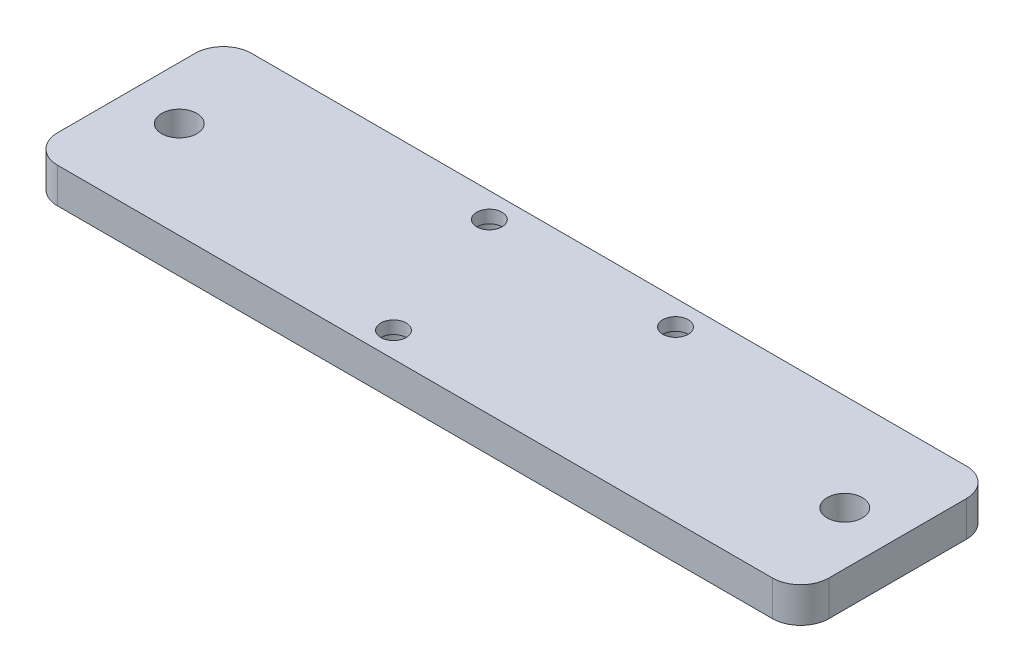
ISO-10303-21;
HEADER;
FILE_DESCRIPTION(('STEP AP214'),'2;1');
FILE_NAME('part.step','',(''),(''),'','','');
FILE_SCHEMA(('AUTOMOTIVE_DESIGN { 1 0 10303 214 1 1 1 1 }'));
ENDSEC;
DATA;
#1=APPLICATION_CONTEXT('core data for automotive mechanical design processes');
#2=APPLICATION_PROTOCOL_DEFINITION('international standard','automotive_design',2000,#1);
#3=PRODUCT_CONTEXT('',#1,'mechanical');
#4=PRODUCT('Part','Part','',(#3));
#5=PRODUCT_RELATED_PRODUCT_CATEGORY('part','',(#4));
#6=PRODUCT_DEFINITION_FORMATION('','',#4);
#7=PRODUCT_DEFINITION_CONTEXT('part definition',#1,'design');
#8=PRODUCT_DEFINITION('design','',#6,#7);
#9=PRODUCT_DEFINITION_SHAPE('','',#8);
#10=(LENGTH_UNIT() NAMED_UNIT(*) SI_UNIT(.MILLI.,.METRE.));
#11=(NAMED_UNIT(*) PLANE_ANGLE_UNIT() SI_UNIT($,.RADIAN.));
#12=(NAMED_UNIT(*) SI_UNIT($,.STERADIAN.) SOLID_ANGLE_UNIT());
#13=UNCERTAINTY_MEASURE_WITH_UNIT(LENGTH_MEASURE(1.E-05),#10,'distance_accuracy_value','');
#14=(GEOMETRIC_REPRESENTATION_CONTEXT(3) GLOBAL_UNCERTAINTY_ASSIGNED_CONTEXT((#13)) GLOBAL_UNIT_ASSIGNED_CONTEXT((#10,
#11,#12)) REPRESENTATION_CONTEXT('',''));
#15=CARTESIAN_POINT('',(0.,0.,0.));
#16=DIRECTION('',(0.,0.,1.));
#17=DIRECTION('',(1.,0.,0.));
#18=AXIS2_PLACEMENT_3D('',#15,#16,#17);
#19=CARTESIAN_POINT('',(16.764,6.35,0.));
#20=DIRECTION('',(0.,-1.,0.));
#21=DIRECTION('',(0.,0.,-1.));
#22=AXIS2_PLACEMENT_3D('',#19,#20,#21);
#23=CYLINDRICAL_SURFACE('',#22,2.286);
#24=CARTESIAN_POINT('',(16.764,6.35,0.));
#25=DIRECTION('',(0.,1.,0.));
#26=DIRECTION('',(0.,0.,1.));
#27=AXIS2_PLACEMENT_3D('',#24,#25,#26);
#28=CIRCLE('',#27,2.286);
#29=CARTESIAN_POINT('',(16.764,6.35,2.286));
#30=VERTEX_POINT('',#29);
#31=EDGE_CURVE('E189',#30,#30,#28,.T.);
#32=ORIENTED_EDGE('',*,*,#31,.T.);
#33=EDGE_LOOP('',(#32));
#34=FACE_BOUND('',#33,.T.);
#35=CARTESIAN_POINT('',(16.764,4.064,0.));
#36=DIRECTION('',(0.,-1.,0.));
#37=DIRECTION('',(0.,0.,-1.));
#38=AXIS2_PLACEMENT_3D('',#35,#36,#37);
#39=CIRCLE('',#38,2.286);
#40=CARTESIAN_POINT('',(16.764,4.064,-2.286));
#41=VERTEX_POINT('',#40);
#42=EDGE_CURVE('E145',#41,#41,#39,.T.);
#43=ORIENTED_EDGE('',*,*,#42,.T.);
#44=EDGE_LOOP('',(#43));
#45=FACE_BOUND('',#44,.T.);
#46=ADVANCED_FACE('F36',(#34,#45),#23,.F.);
#47=CARTESIAN_POINT('',(-16.764,6.35,0.));
#48=DIRECTION('',(0.,-1.,0.));
#49=DIRECTION('',(0.,0.,-1.));
#50=AXIS2_PLACEMENT_3D('',#47,#48,#49);
#51=CYLINDRICAL_SURFACE('',#50,2.286);
#52=CARTESIAN_POINT('',(-16.764,6.35,0.));
#53=DIRECTION('',(0.,1.,0.));
#54=DIRECTION('',(0.,0.,-1.));
#55=AXIS2_PLACEMENT_3D('',#52,#53,#54);
#56=CIRCLE('',#55,2.286);
#57=CARTESIAN_POINT('',(-16.764,6.35,-2.286));
#58=VERTEX_POINT('',#57);
#59=EDGE_CURVE('E191',#58,#58,#56,.T.);
#60=ORIENTED_EDGE('',*,*,#59,.T.);
#61=EDGE_LOOP('',(#60));
#62=FACE_BOUND('',#61,.T.);
#63=CARTESIAN_POINT('',(-16.764,4.064,0.));
#64=DIRECTION('',(0.,-1.,0.));
#65=DIRECTION('',(0.,0.,-1.));
#66=AXIS2_PLACEMENT_3D('',#63,#64,#65);
#67=CIRCLE('',#66,2.286);
#68=CARTESIAN_POINT('',(-16.764,4.064,-2.286));
#69=VERTEX_POINT('',#68);
#70=EDGE_CURVE('E141',#69,#69,#67,.T.);
#71=ORIENTED_EDGE('',*,*,#70,.T.);
#72=EDGE_LOOP('',(#71));
#73=FACE_BOUND('',#72,.T.);
#74=ADVANCED_FACE('F264',(#62,#73),#51,.F.);
#75=CARTESIAN_POINT('',(-8.12799999999999,6.35,25.908));
#76=DIRECTION('',(0.,-1.,0.));
#77=DIRECTION('',(0.,0.,-1.));
#78=AXIS2_PLACEMENT_3D('',#75,#76,#77);
#79=CYLINDRICAL_SURFACE('',#78,2.286);
#80=CARTESIAN_POINT('',(-8.12799999999999,6.35,25.908));
#81=DIRECTION('',(0.,1.,0.));
#82=DIRECTION('',(0.,0.,1.));
#83=AXIS2_PLACEMENT_3D('',#80,#81,#82);
#84=CIRCLE('',#83,2.286);
#85=CARTESIAN_POINT('',(-8.12799999999999,6.35,28.194));
#86=VERTEX_POINT('',#85);
#87=EDGE_CURVE('E199',#86,#86,#84,.T.);
#88=ORIENTED_EDGE('',*,*,#87,.T.);
#89=EDGE_LOOP('',(#88));
#90=FACE_BOUND('',#89,.T.);
#91=CARTESIAN_POINT('',(-8.12799999999999,4.064,25.908));
#92=DIRECTION('',(0.,-1.,0.));
#93=DIRECTION('',(0.,0.,-1.));
#94=AXIS2_PLACEMENT_3D('',#91,#92,#93);
#95=CIRCLE('',#94,2.286);
#96=CARTESIAN_POINT('',(-8.12799999999999,4.064,23.622));
#97=VERTEX_POINT('',#96);
#98=EDGE_CURVE('E138',#97,#97,#95,.T.);
#99=ORIENTED_EDGE('',*,*,#98,.T.);
#100=EDGE_LOOP('',(#99));
#101=FACE_BOUND('',#100,.T.);
#102=ADVANCED_FACE('F270',(#90,#101),#79,.F.);
#103=CARTESIAN_POINT('',(0.,6.35,0.));
#104=DIRECTION('',(0.,1.,0.));
#105=DIRECTION('',(0.,0.,1.));
#106=AXIS2_PLACEMENT_3D('',#103,#104,#105);
#107=PLANE('',#106);
#108=CARTESIAN_POINT('',(60.198,6.35,12.954));
#109=DIRECTION('',(0.,1.,0.));
#110=DIRECTION('',(0.,0.,1.));
#111=AXIS2_PLACEMENT_3D('',#108,#109,#110);
#112=CIRCLE('',#111,3.175);
#113=CARTESIAN_POINT('',(60.198,6.35,16.129));
#114=VERTEX_POINT('',#113);
#115=EDGE_CURVE('E202',#114,#114,#112,.T.);
#116=ORIENTED_EDGE('',*,*,#115,.F.);
#117=EDGE_LOOP('',(#116));
#118=FACE_BOUND('',#117,.T.);
#119=ORIENTED_EDGE('',*,*,#59,.F.);
#120=EDGE_LOOP('',(#119));
#121=FACE_BOUND('',#120,.T.);
#122=DIRECTION('',(0.,0.,-1.));
#123=VECTOR('',#122,1.);
#124=CARTESIAN_POINT('',(69.723,6.35,30.4165));
#125=LINE('',#124,#123);
#126=CARTESIAN_POINT('',(69.723,6.35,25.3365));
#127=VERTEX_POINT('',#126);
#128=CARTESIAN_POINT('',(69.723,6.35,0.571499999999996));
#129=VERTEX_POINT('',#128);
#130=EDGE_CURVE('E183',#127,#129,#125,.T.);
#131=ORIENTED_EDGE('',*,*,#130,.T.);
#132=CARTESIAN_POINT('',(64.643,6.35,0.571499999999997));
#133=DIRECTION('',(0.,1.,0.));
#134=DIRECTION('',(0.,0.,1.));
#135=AXIS2_PLACEMENT_3D('',#132,#133,#134);
#136=CIRCLE('',#135,5.08);
#137=CARTESIAN_POINT('',(64.643,6.35,-4.5085));
#138=VERTEX_POINT('',#137);
#139=EDGE_CURVE('E162',#129,#138,#136,.T.);
#140=ORIENTED_EDGE('',*,*,#139,.T.);
#141=DIRECTION('',(-1.,0.,0.));
#142=VECTOR('',#141,1.);
#143=CARTESIAN_POINT('',(-69.1846838076504,6.35,-4.50849999999999));
#144=LINE('',#143,#142);
#145=CARTESIAN_POINT('',(-64.1046838076504,6.35,-4.50849999999999));
#146=VERTEX_POINT('',#145);
#147=EDGE_CURVE('E121',#138,#146,#144,.T.);
#148=ORIENTED_EDGE('',*,*,#147,.T.);
#149=CARTESIAN_POINT('',(-64.1046838076504,6.35,0.571500000000013));
#150=DIRECTION('',(0.,1.,0.));
#151=DIRECTION('',(0.,0.,1.));
#152=AXIS2_PLACEMENT_3D('',#149,#150,#151);
#153=CIRCLE('',#152,5.08);
#154=CARTESIAN_POINT('',(-69.1846838076504,6.35,0.571500000000013));
#155=VERTEX_POINT('',#154);
#156=EDGE_CURVE('E57',#146,#155,#153,.T.);
#157=ORIENTED_EDGE('',*,*,#156,.T.);
#158=DIRECTION('',(0.,0.,1.));
#159=VECTOR('',#158,1.);
#160=CARTESIAN_POINT('',(-69.1846838076504,6.35,30.4165));
#161=LINE('',#160,#159);
#162=CARTESIAN_POINT('',(-69.1846838076504,6.35,25.3365));
#163=VERTEX_POINT('',#162);
#164=EDGE_CURVE('E149',#155,#163,#161,.T.);
#165=ORIENTED_EDGE('',*,*,#164,.T.);
#166=CARTESIAN_POINT('',(-64.1046838076504,6.35,25.3365));
#167=DIRECTION('',(0.,1.,0.));
#168=DIRECTION('',(0.,0.,1.));
#169=AXIS2_PLACEMENT_3D('',#166,#167,#168);
#170=CIRCLE('',#169,5.08);
#171=CARTESIAN_POINT('',(-64.1046838076504,6.35,30.4165));
#172=VERTEX_POINT('',#171);
#173=EDGE_CURVE('E157',#163,#172,#170,.T.);
#174=ORIENTED_EDGE('',*,*,#173,.T.);
#175=DIRECTION('',(1.,0.,0.));
#176=VECTOR('',#175,1.);
#177=CARTESIAN_POINT('',(-69.1846838076504,6.35,30.4165));
#178=LINE('',#177,#176);
#179=CARTESIAN_POINT('',(64.643,6.35,30.4165));
#180=VERTEX_POINT('',#179);
#181=EDGE_CURVE('E132',#172,#180,#178,.T.);
#182=ORIENTED_EDGE('',*,*,#181,.T.);
#183=CARTESIAN_POINT('',(64.643,6.35,25.3365));
#184=DIRECTION('',(0.,1.,0.));
#185=DIRECTION('',(0.,0.,1.));
#186=AXIS2_PLACEMENT_3D('',#183,#184,#185);
#187=CIRCLE('',#186,5.08);
#188=EDGE_CURVE('E160',#180,#127,#187,.T.);
#189=ORIENTED_EDGE('',*,*,#188,.T.);
#190=EDGE_LOOP('',(#131,#140,#148,#157,#165,#174,#182,#189));
#191=FACE_BOUND('',#190,.T.);
#192=ORIENTED_EDGE('',*,*,#31,.F.);
#193=EDGE_LOOP('',(#192));
#194=FACE_BOUND('',#193,.T.);
#195=ORIENTED_EDGE('',*,*,#87,.F.);
#196=EDGE_LOOP('',(#195));
#197=FACE_BOUND('',#196,.T.);
#198=CARTESIAN_POINT('',(-59.6596838076504,6.35,12.954));
#199=DIRECTION('',(0.,1.,0.));
#200=DIRECTION('',(0.,0.,1.));
#201=AXIS2_PLACEMENT_3D('',#198,#199,#200);
#202=CIRCLE('',#201,3.175);
#203=CARTESIAN_POINT('',(-59.6596838076504,6.35,16.129));
#204=VERTEX_POINT('',#203);
#205=EDGE_CURVE('E206',#204,#204,#202,.T.);
#206=ORIENTED_EDGE('',*,*,#205,.F.);
#207=EDGE_LOOP('',(#206));
#208=FACE_BOUND('',#207,.T.);
#209=ADVANCED_FACE('F179',(#118,#121,#191,#194,#197,#208),#107,.T.);
#210=CARTESIAN_POINT('',(0.,0.,0.));
#211=DIRECTION('',(0.,1.,0.));
#212=DIRECTION('',(0.,0.,1.));
#213=AXIS2_PLACEMENT_3D('',#210,#211,#212);
#214=PLANE('',#213);
#215=CARTESIAN_POINT('',(-8.12799999999999,0.,25.908));
#216=DIRECTION('',(0.,-1.,0.));
#217=DIRECTION('',(0.,0.,-1.));
#218=AXIS2_PLACEMENT_3D('',#215,#216,#217);
#219=CIRCLE('',#218,3.556);
#220=CARTESIAN_POINT('',(-8.12799999999999,0.,22.352));
#221=VERTEX_POINT('',#220);
#222=EDGE_CURVE('E225',#221,#221,#219,.T.);
#223=ORIENTED_EDGE('',*,*,#222,.F.);
#224=EDGE_LOOP('',(#223));
#225=FACE_BOUND('',#224,.T.);
#226=CARTESIAN_POINT('',(-16.764,0.,0.));
#227=DIRECTION('',(0.,-1.,0.));
#228=DIRECTION('',(0.,0.,-1.));
#229=AXIS2_PLACEMENT_3D('',#226,#227,#228);
#230=CIRCLE('',#229,3.556);
#231=CARTESIAN_POINT('',(-16.764,0.,-3.556));
#232=VERTEX_POINT('',#231);
#233=EDGE_CURVE('E222',#232,#232,#230,.T.);
#234=ORIENTED_EDGE('',*,*,#233,.F.);
#235=EDGE_LOOP('',(#234));
#236=FACE_BOUND('',#235,.T.);
#237=CARTESIAN_POINT('',(16.764,0.,0.));
#238=DIRECTION('',(0.,-1.,0.));
#239=DIRECTION('',(0.,0.,-1.));
#240=AXIS2_PLACEMENT_3D('',#237,#238,#239);
#241=CIRCLE('',#240,3.556);
#242=CARTESIAN_POINT('',(16.764,0.,-3.556));
#243=VERTEX_POINT('',#242);
#244=EDGE_CURVE('E216',#243,#243,#241,.T.);
#245=ORIENTED_EDGE('',*,*,#244,.F.);
#246=EDGE_LOOP('',(#245));
#247=FACE_BOUND('',#246,.T.);
#248=DIRECTION('',(-1.,0.,0.));
#249=VECTOR('',#248,1.);
#250=CARTESIAN_POINT('',(-69.1846838076504,0.,-4.50849999999999));
#251=LINE('',#250,#249);
#252=CARTESIAN_POINT('',(64.643,0.,-4.5085));
#253=VERTEX_POINT('',#252);
#254=CARTESIAN_POINT('',(-64.1046838076504,0.,-4.50849999999999));
#255=VERTEX_POINT('',#254);
#256=EDGE_CURVE('E119',#253,#255,#251,.T.);
#257=ORIENTED_EDGE('',*,*,#256,.F.);
#258=CARTESIAN_POINT('',(64.643,0.,0.571499999999997));
#259=DIRECTION('',(0.,1.,0.));
#260=DIRECTION('',(0.,0.,1.));
#261=AXIS2_PLACEMENT_3D('',#258,#259,#260);
#262=CIRCLE('',#261,5.08);
#263=CARTESIAN_POINT('',(69.723,0.,0.571499999999996));
#264=VERTEX_POINT('',#263);
#265=EDGE_CURVE('E102',#253,#264,#262,.F.);
#266=ORIENTED_EDGE('',*,*,#265,.T.);
#267=DIRECTION('',(0.,0.,-1.));
#268=VECTOR('',#267,1.);
#269=CARTESIAN_POINT('',(69.723,0.,30.4165));
#270=LINE('',#269,#268);
#271=CARTESIAN_POINT('',(69.723,0.,25.3365));
#272=VERTEX_POINT('',#271);
#273=EDGE_CURVE('E130',#272,#264,#270,.T.);
#274=ORIENTED_EDGE('',*,*,#273,.F.);
#275=CARTESIAN_POINT('',(64.643,0.,25.3365));
#276=DIRECTION('',(0.,1.,0.));
#277=DIRECTION('',(0.,0.,1.));
#278=AXIS2_PLACEMENT_3D('',#275,#276,#277);
#279=CIRCLE('',#278,5.08);
#280=CARTESIAN_POINT('',(64.643,0.,30.4165));
#281=VERTEX_POINT('',#280);
#282=EDGE_CURVE('E113',#272,#281,#279,.F.);
#283=ORIENTED_EDGE('',*,*,#282,.T.);
#284=DIRECTION('',(1.,0.,0.));
#285=VECTOR('',#284,1.);
#286=CARTESIAN_POINT('',(-69.1846838076504,0.,30.4165));
#287=LINE('',#286,#285);
#288=CARTESIAN_POINT('',(-64.1046838076504,0.,30.4165));
#289=VERTEX_POINT('',#288);
#290=EDGE_CURVE('E134',#289,#281,#287,.T.);
#291=ORIENTED_EDGE('',*,*,#290,.F.);
#292=CARTESIAN_POINT('',(-64.1046838076504,0.,25.3365));
#293=DIRECTION('',(0.,1.,0.));
#294=DIRECTION('',(0.,0.,1.));
#295=AXIS2_PLACEMENT_3D('',#292,#293,#294);
#296=CIRCLE('',#295,5.08);
#297=CARTESIAN_POINT('',(-69.1846838076504,0.,25.3365));
#298=VERTEX_POINT('',#297);
#299=EDGE_CURVE('E122',#289,#298,#296,.F.);
#300=ORIENTED_EDGE('',*,*,#299,.T.);
#301=DIRECTION('',(0.,0.,1.));
#302=VECTOR('',#301,1.);
#303=CARTESIAN_POINT('',(-69.1846838076504,0.,30.4165));
#304=LINE('',#303,#302);
#305=CARTESIAN_POINT('',(-69.1846838076504,0.,0.571500000000013));
#306=VERTEX_POINT('',#305);
#307=EDGE_CURVE('E129',#306,#298,#304,.T.);
#308=ORIENTED_EDGE('',*,*,#307,.F.);
#309=CARTESIAN_POINT('',(-64.1046838076504,0.,0.571500000000013));
#310=DIRECTION('',(0.,1.,0.));
#311=DIRECTION('',(0.,0.,1.));
#312=AXIS2_PLACEMENT_3D('',#309,#310,#311);
#313=CIRCLE('',#312,5.08);
#314=EDGE_CURVE('E128',#306,#255,#313,.F.);
#315=ORIENTED_EDGE('',*,*,#314,.T.);
#316=EDGE_LOOP('',(#257,#266,#274,#283,#291,#300,#308,#315));
#317=FACE_BOUND('',#316,.T.);
#318=CARTESIAN_POINT('',(60.198,0.,12.954));
#319=DIRECTION('',(0.,1.,0.));
#320=DIRECTION('',(0.,0.,1.));
#321=AXIS2_PLACEMENT_3D('',#318,#319,#320);
#322=CIRCLE('',#321,3.175);
#323=CARTESIAN_POINT('',(60.198,0.,16.129));
#324=VERTEX_POINT('',#323);
#325=EDGE_CURVE('E203',#324,#324,#322,.T.);
#326=ORIENTED_EDGE('',*,*,#325,.T.);
#327=EDGE_LOOP('',(#326));
#328=FACE_BOUND('',#327,.T.);
#329=CARTESIAN_POINT('',(-59.6596838076504,0.,12.954));
#330=DIRECTION('',(0.,1.,0.));
#331=DIRECTION('',(0.,0.,1.));
#332=AXIS2_PLACEMENT_3D('',#329,#330,#331);
#333=CIRCLE('',#332,3.175);
#334=CARTESIAN_POINT('',(-59.6596838076504,0.,16.129));
#335=VERTEX_POINT('',#334);
#336=EDGE_CURVE('E148',#335,#335,#333,.T.);
#337=ORIENTED_EDGE('',*,*,#336,.T.);
#338=EDGE_LOOP('',(#337));
#339=FACE_BOUND('',#338,.T.);
#340=ADVANCED_FACE('F125',(#225,#236,#247,#317,#328,#339),#214,.F.);
#341=CARTESIAN_POINT('',(-69.1846838076504,6.35,30.4165));
#342=DIRECTION('',(0.,0.,-1.));
#343=DIRECTION('',(-1.,0.,0.));
#344=AXIS2_PLACEMENT_3D('',#341,#342,#343);
#345=PLANE('',#344);
#346=ORIENTED_EDGE('',*,*,#290,.T.);
#347=DIRECTION('',(0.,-1.,0.));
#348=VECTOR('',#347,1.);
#349=CARTESIAN_POINT('',(64.643,6.35,30.4165));
#350=LINE('',#349,#348);
#351=EDGE_CURVE('E167',#281,#180,#350,.F.);
#352=ORIENTED_EDGE('',*,*,#351,.T.);
#353=ORIENTED_EDGE('',*,*,#181,.F.);
#354=DIRECTION('',(0.,-1.,0.));
#355=VECTOR('',#354,1.);
#356=CARTESIAN_POINT('',(-64.1046838076504,6.35,30.4165));
#357=LINE('',#356,#355);
#358=EDGE_CURVE('E164',#172,#289,#357,.T.);
#359=ORIENTED_EDGE('',*,*,#358,.T.);
#360=EDGE_LOOP('',(#346,#352,#353,#359));
#361=FACE_BOUND('',#360,.T.);
#362=ADVANCED_FACE('F173',(#361),#345,.F.);
#363=CARTESIAN_POINT('',(69.723,6.35,30.4165));
#364=DIRECTION('',(-1.,0.,0.));
#365=DIRECTION('',(0.,0.,1.));
#366=AXIS2_PLACEMENT_3D('',#363,#364,#365);
#367=PLANE('',#366);
#368=ORIENTED_EDGE('',*,*,#273,.T.);
#369=DIRECTION('',(0.,-1.,0.));
#370=VECTOR('',#369,1.);
#371=CARTESIAN_POINT('',(69.723,6.35,0.571499999999996));
#372=LINE('',#371,#370);
#373=EDGE_CURVE('E107',#264,#129,#372,.F.);
#374=ORIENTED_EDGE('',*,*,#373,.T.);
#375=ORIENTED_EDGE('',*,*,#130,.F.);
#376=DIRECTION('',(0.,-1.,0.));
#377=VECTOR('',#376,1.);
#378=CARTESIAN_POINT('',(69.723,6.35,25.3365));
#379=LINE('',#378,#377);
#380=EDGE_CURVE('E112',#127,#272,#379,.T.);
#381=ORIENTED_EDGE('',*,*,#380,.T.);
#382=EDGE_LOOP('',(#368,#374,#375,#381));
#383=FACE_BOUND('',#382,.T.);
#384=ADVANCED_FACE('F188',(#383),#367,.F.);
#385=CARTESIAN_POINT('',(-69.1846838076504,6.35,-4.50849999999999));
#386=DIRECTION('',(0.,0.,1.));
#387=DIRECTION('',(1.,0.,0.));
#388=AXIS2_PLACEMENT_3D('',#385,#386,#387);
#389=PLANE('',#388);
#390=ORIENTED_EDGE('',*,*,#147,.F.);
#391=DIRECTION('',(0.,-1.,0.));
#392=VECTOR('',#391,1.);
#393=CARTESIAN_POINT('',(64.643,6.35,-4.5085));
#394=LINE('',#393,#392);
#395=EDGE_CURVE('E106',#138,#253,#394,.T.);
#396=ORIENTED_EDGE('',*,*,#395,.T.);
#397=ORIENTED_EDGE('',*,*,#256,.T.);
#398=DIRECTION('',(0.,-1.,0.));
#399=VECTOR('',#398,1.);
#400=CARTESIAN_POINT('',(-64.1046838076504,6.35,-4.50849999999999));
#401=LINE('',#400,#399);
#402=EDGE_CURVE('E123',#255,#146,#401,.F.);
#403=ORIENTED_EDGE('',*,*,#402,.T.);
#404=EDGE_LOOP('',(#390,#396,#397,#403));
#405=FACE_BOUND('',#404,.T.);
#406=ADVANCED_FACE('F118',(#405),#389,.F.);
#407=CARTESIAN_POINT('',(-69.1846838076504,6.35,30.4165));
#408=DIRECTION('',(1.,0.,0.));
#409=DIRECTION('',(0.,0.,-1.));
#410=AXIS2_PLACEMENT_3D('',#407,#408,#409);
#411=PLANE('',#410);
#412=ORIENTED_EDGE('',*,*,#164,.F.);
#413=DIRECTION('',(0.,-1.,0.));
#414=VECTOR('',#413,1.);
#415=CARTESIAN_POINT('',(-69.1846838076504,6.35,0.571500000000013));
#416=LINE('',#415,#414);
#417=EDGE_CURVE('E11',#155,#306,#416,.T.);
#418=ORIENTED_EDGE('',*,*,#417,.T.);
#419=ORIENTED_EDGE('',*,*,#307,.T.);
#420=DIRECTION('',(0.,-1.,0.));
#421=VECTOR('',#420,1.);
#422=CARTESIAN_POINT('',(-69.1846838076504,6.35,25.3365));
#423=LINE('',#422,#421);
#424=EDGE_CURVE('E44',#298,#163,#423,.F.);
#425=ORIENTED_EDGE('',*,*,#424,.T.);
#426=EDGE_LOOP('',(#412,#418,#419,#425));
#427=FACE_BOUND('',#426,.T.);
#428=ADVANCED_FACE('F279',(#427),#411,.F.);
#429=CARTESIAN_POINT('',(60.198,6.35,12.954));
#430=DIRECTION('',(0.,-1.,0.));
#431=DIRECTION('',(0.,0.,-1.));
#432=AXIS2_PLACEMENT_3D('',#429,#430,#431);
#433=CYLINDRICAL_SURFACE('',#432,3.175);
#434=ORIENTED_EDGE('',*,*,#115,.T.);
#435=EDGE_LOOP('',(#434));
#436=FACE_BOUND('',#435,.T.);
#437=ORIENTED_EDGE('',*,*,#325,.F.);
#438=EDGE_LOOP('',(#437));
#439=FACE_BOUND('',#438,.T.);
#440=ADVANCED_FACE('F282',(#436,#439),#433,.F.);
#441=CARTESIAN_POINT('',(-59.6596838076504,6.35,12.954));
#442=DIRECTION('',(0.,-1.,0.));
#443=DIRECTION('',(0.,0.,-1.));
#444=AXIS2_PLACEMENT_3D('',#441,#442,#443);
#445=CYLINDRICAL_SURFACE('',#444,3.175);
#446=ORIENTED_EDGE('',*,*,#205,.T.);
#447=EDGE_LOOP('',(#446));
#448=FACE_BOUND('',#447,.T.);
#449=ORIENTED_EDGE('',*,*,#336,.F.);
#450=EDGE_LOOP('',(#449));
#451=FACE_BOUND('',#450,.T.);
#452=ADVANCED_FACE('F236',(#448,#451),#445,.F.);
#453=CARTESIAN_POINT('',(-8.12799999999999,4.064,25.908));
#454=DIRECTION('',(0.,-1.,0.));
#455=DIRECTION('',(0.,0.,-1.));
#456=AXIS2_PLACEMENT_3D('',#453,#454,#455);
#457=CYLINDRICAL_SURFACE('',#456,3.556);
#458=CARTESIAN_POINT('',(-8.12799999999999,4.064,25.908));
#459=DIRECTION('',(0.,-1.,0.));
#460=DIRECTION('',(0.,0.,-1.));
#461=AXIS2_PLACEMENT_3D('',#458,#459,#460);
#462=CIRCLE('',#461,3.556);
#463=CARTESIAN_POINT('',(-8.12799999999999,4.064,22.352));
#464=VERTEX_POINT('',#463);
#465=EDGE_CURVE('E142',#464,#464,#462,.T.);
#466=ORIENTED_EDGE('',*,*,#465,.F.);
#467=EDGE_LOOP('',(#466));
#468=FACE_BOUND('',#467,.T.);
#469=ORIENTED_EDGE('',*,*,#222,.T.);
#470=EDGE_LOOP('',(#469));
#471=FACE_BOUND('',#470,.T.);
#472=ADVANCED_FACE('F233',(#468,#471),#457,.F.);
#473=CARTESIAN_POINT('',(-8.12799999999999,4.064,25.908));
#474=DIRECTION('',(0.,-1.,0.));
#475=DIRECTION('',(0.,0.,-1.));
#476=AXIS2_PLACEMENT_3D('',#473,#474,#475);
#477=PLANE('',#476);
#478=ORIENTED_EDGE('',*,*,#98,.F.);
#479=EDGE_LOOP('',(#478));
#480=FACE_BOUND('',#479,.T.);
#481=ORIENTED_EDGE('',*,*,#465,.T.);
#482=EDGE_LOOP('',(#481));
#483=FACE_BOUND('',#482,.T.);
#484=ADVANCED_FACE('F231',(#480,#483),#477,.T.);
#485=CARTESIAN_POINT('',(-16.764,4.064,0.));
#486=DIRECTION('',(0.,-1.,0.));
#487=DIRECTION('',(0.,0.,-1.));
#488=AXIS2_PLACEMENT_3D('',#485,#486,#487);
#489=CYLINDRICAL_SURFACE('',#488,3.556);
#490=CARTESIAN_POINT('',(-16.764,4.064,0.));
#491=DIRECTION('',(0.,-1.,0.));
#492=DIRECTION('',(0.,0.,-1.));
#493=AXIS2_PLACEMENT_3D('',#490,#491,#492);
#494=CIRCLE('',#493,3.556);
#495=CARTESIAN_POINT('',(-16.764,4.064,-3.556));
#496=VERTEX_POINT('',#495);
#497=EDGE_CURVE('E219',#496,#496,#494,.T.);
#498=ORIENTED_EDGE('',*,*,#497,.F.);
#499=EDGE_LOOP('',(#498));
#500=FACE_BOUND('',#499,.T.);
#501=ORIENTED_EDGE('',*,*,#233,.T.);
#502=EDGE_LOOP('',(#501));
#503=FACE_BOUND('',#502,.T.);
#504=ADVANCED_FACE('F259',(#500,#503),#489,.F.);
#505=CARTESIAN_POINT('',(-16.764,4.064,0.));
#506=DIRECTION('',(0.,-1.,0.));
#507=DIRECTION('',(0.,0.,-1.));
#508=AXIS2_PLACEMENT_3D('',#505,#506,#507);
#509=PLANE('',#508);
#510=ORIENTED_EDGE('',*,*,#70,.F.);
#511=EDGE_LOOP('',(#510));
#512=FACE_BOUND('',#511,.T.);
#513=ORIENTED_EDGE('',*,*,#497,.T.);
#514=EDGE_LOOP('',(#513));
#515=FACE_BOUND('',#514,.T.);
#516=ADVANCED_FACE('F250',(#512,#515),#509,.T.);
#517=CARTESIAN_POINT('',(16.764,4.064,0.));
#518=DIRECTION('',(0.,-1.,0.));
#519=DIRECTION('',(0.,0.,-1.));
#520=AXIS2_PLACEMENT_3D('',#517,#518,#519);
#521=CYLINDRICAL_SURFACE('',#520,3.556);
#522=CARTESIAN_POINT('',(16.764,4.064,0.));
#523=DIRECTION('',(0.,-1.,0.));
#524=DIRECTION('',(0.,0.,-1.));
#525=AXIS2_PLACEMENT_3D('',#522,#523,#524);
#526=CIRCLE('',#525,3.556);
#527=CARTESIAN_POINT('',(16.764,4.064,-3.556));
#528=VERTEX_POINT('',#527);
#529=EDGE_CURVE('E213',#528,#528,#526,.T.);
#530=ORIENTED_EDGE('',*,*,#529,.F.);
#531=EDGE_LOOP('',(#530));
#532=FACE_BOUND('',#531,.T.);
#533=ORIENTED_EDGE('',*,*,#244,.T.);
#534=EDGE_LOOP('',(#533));
#535=FACE_BOUND('',#534,.T.);
#536=ADVANCED_FACE('F247',(#532,#535),#521,.F.);
#537=CARTESIAN_POINT('',(16.764,4.064,0.));
#538=DIRECTION('',(0.,-1.,0.));
#539=DIRECTION('',(0.,0.,-1.));
#540=AXIS2_PLACEMENT_3D('',#537,#538,#539);
#541=PLANE('',#540);
#542=ORIENTED_EDGE('',*,*,#42,.F.);
#543=EDGE_LOOP('',(#542));
#544=FACE_BOUND('',#543,.T.);
#545=ORIENTED_EDGE('',*,*,#529,.T.);
#546=EDGE_LOOP('',(#545));
#547=FACE_BOUND('',#546,.T.);
#548=ADVANCED_FACE('F249',(#544,#547),#541,.T.);
#549=CARTESIAN_POINT('',(64.643,6.35,0.571499999999997));
#550=DIRECTION('',(0.,-1.,0.));
#551=DIRECTION('',(0.,0.,-1.));
#552=AXIS2_PLACEMENT_3D('',#549,#550,#551);
#553=CYLINDRICAL_SURFACE('',#552,5.08);
#554=ORIENTED_EDGE('',*,*,#139,.F.);
#555=ORIENTED_EDGE('',*,*,#373,.F.);
#556=ORIENTED_EDGE('',*,*,#265,.F.);
#557=ORIENTED_EDGE('',*,*,#395,.F.);
#558=EDGE_LOOP('',(#554,#555,#556,#557));
#559=FACE_BOUND('',#558,.T.);
#560=ADVANCED_FACE('F105',(#559),#553,.T.);
#561=CARTESIAN_POINT('',(64.643,6.35,25.3365));
#562=DIRECTION('',(0.,-1.,0.));
#563=DIRECTION('',(0.,0.,-1.));
#564=AXIS2_PLACEMENT_3D('',#561,#562,#563);
#565=CYLINDRICAL_SURFACE('',#564,5.08);
#566=ORIENTED_EDGE('',*,*,#188,.F.);
#567=ORIENTED_EDGE('',*,*,#351,.F.);
#568=ORIENTED_EDGE('',*,*,#282,.F.);
#569=ORIENTED_EDGE('',*,*,#380,.F.);
#570=EDGE_LOOP('',(#566,#567,#568,#569));
#571=FACE_BOUND('',#570,.T.);
#572=ADVANCED_FACE('F186',(#571),#565,.T.);
#573=CARTESIAN_POINT('',(-64.1046838076504,6.35,0.571500000000013));
#574=DIRECTION('',(0.,-1.,0.));
#575=DIRECTION('',(0.,0.,-1.));
#576=AXIS2_PLACEMENT_3D('',#573,#574,#575);
#577=CYLINDRICAL_SURFACE('',#576,5.08);
#578=ORIENTED_EDGE('',*,*,#156,.F.);
#579=ORIENTED_EDGE('',*,*,#402,.F.);
#580=ORIENTED_EDGE('',*,*,#314,.F.);
#581=ORIENTED_EDGE('',*,*,#417,.F.);
#582=EDGE_LOOP('',(#578,#579,#580,#581));
#583=FACE_BOUND('',#582,.T.);
#584=ADVANCED_FACE('F292',(#583),#577,.T.);
#585=CARTESIAN_POINT('',(-64.1046838076504,6.35,25.3365));
#586=DIRECTION('',(0.,-1.,0.));
#587=DIRECTION('',(0.,0.,-1.));
#588=AXIS2_PLACEMENT_3D('',#585,#586,#587);
#589=CYLINDRICAL_SURFACE('',#588,5.08);
#590=ORIENTED_EDGE('',*,*,#173,.F.);
#591=ORIENTED_EDGE('',*,*,#424,.F.);
#592=ORIENTED_EDGE('',*,*,#299,.F.);
#593=ORIENTED_EDGE('',*,*,#358,.F.);
#594=EDGE_LOOP('',(#590,#591,#592,#593));
#595=FACE_BOUND('',#594,.T.);
#596=ADVANCED_FACE('F38',(#595),#589,.T.);
#597=CLOSED_SHELL('',(#46,#74,#102,#209,#340,#362,#384,#406,#428,#440,#452,#472,#484,#504,#516,
#536,#548,#560,#572,#584,#596));
#598=MANIFOLD_SOLID_BREP('B2',#597);
#599=ADVANCED_BREP_SHAPE_REPRESENTATION('',(#18,#598),#14);
#600=SHAPE_DEFINITION_REPRESENTATION(#9,#599);
ENDSEC;
END-ISO-10303-21;
